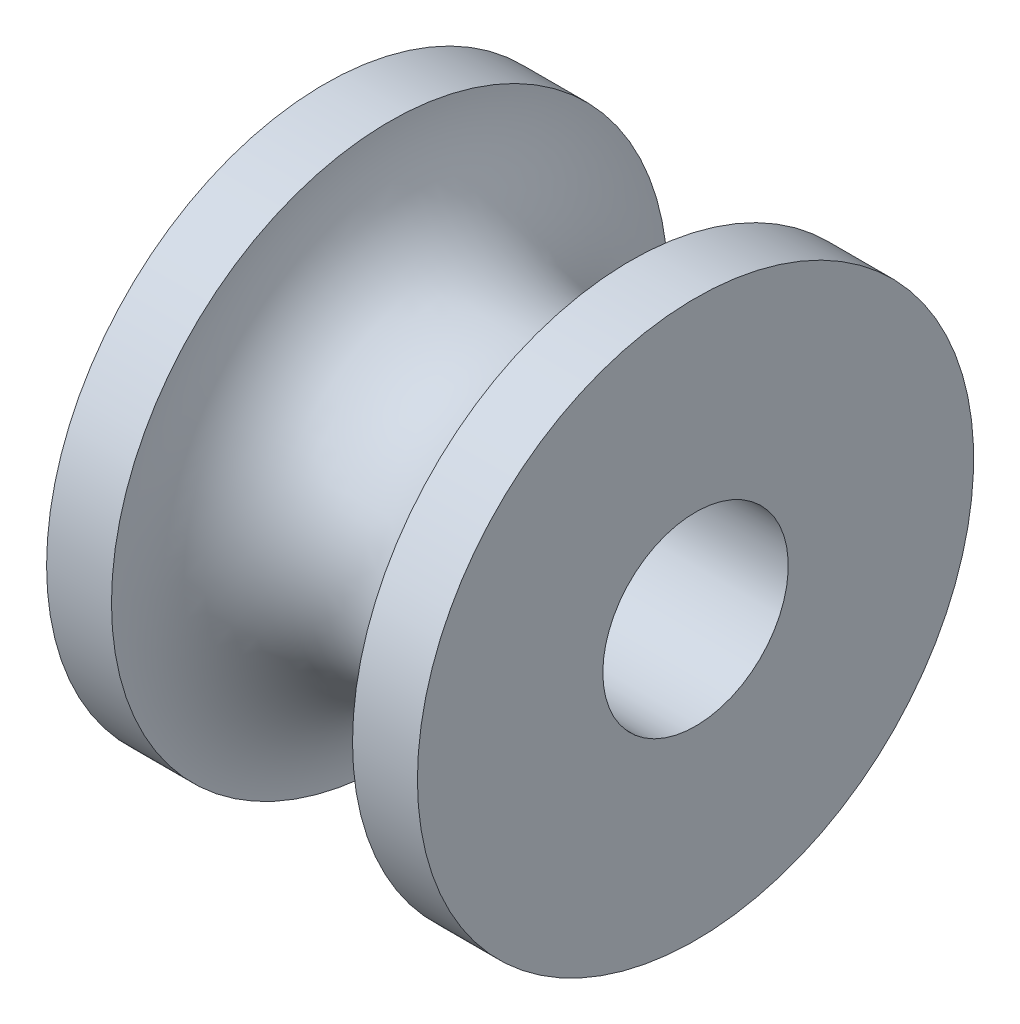
ISO-10303-21;
HEADER;
FILE_DESCRIPTION(('STEP AP214'),'2;1');
FILE_NAME('part.step','',(''),(''),'','','');
FILE_SCHEMA(('AUTOMOTIVE_DESIGN { 1 0 10303 214 1 1 1 1 }'));
ENDSEC;
DATA;
#1=APPLICATION_CONTEXT('core data for automotive mechanical design processes');
#2=APPLICATION_PROTOCOL_DEFINITION('international standard','automotive_design',2000,#1);
#3=PRODUCT_CONTEXT('',#1,'mechanical');
#4=PRODUCT('Part','Part','',(#3));
#5=PRODUCT_RELATED_PRODUCT_CATEGORY('part','',(#4));
#6=PRODUCT_DEFINITION_FORMATION('','',#4);
#7=PRODUCT_DEFINITION_CONTEXT('part definition',#1,'design');
#8=PRODUCT_DEFINITION('design','',#6,#7);
#9=PRODUCT_DEFINITION_SHAPE('','',#8);
#10=(LENGTH_UNIT() NAMED_UNIT(*) SI_UNIT(.MILLI.,.METRE.));
#11=(NAMED_UNIT(*) PLANE_ANGLE_UNIT() SI_UNIT($,.RADIAN.));
#12=(NAMED_UNIT(*) SI_UNIT($,.STERADIAN.) SOLID_ANGLE_UNIT());
#13=UNCERTAINTY_MEASURE_WITH_UNIT(LENGTH_MEASURE(1.E-05),#10,'distance_accuracy_value','');
#14=(GEOMETRIC_REPRESENTATION_CONTEXT(3) GLOBAL_UNCERTAINTY_ASSIGNED_CONTEXT((#13)) GLOBAL_UNIT_ASSIGNED_CONTEXT((#10,
#11,#12)) REPRESENTATION_CONTEXT('',''));
#15=CARTESIAN_POINT('',(0.,0.,0.));
#16=DIRECTION('',(0.,0.,1.));
#17=DIRECTION('',(1.,0.,0.));
#18=AXIS2_PLACEMENT_3D('',#15,#16,#17);
#19=CARTESIAN_POINT('',(-4.,-2.,0.));
#20=DIRECTION('',(-1.,0.,0.));
#21=DIRECTION('',(0.,0.,1.));
#22=AXIS2_PLACEMENT_3D('',#19,#20,#21);
#23=PLANE('',#22);
#24=CARTESIAN_POINT('',(-4.,0.,0.));
#25=DIRECTION('',(-1.,0.,0.));
#26=DIRECTION('',(0.,0.,1.));
#27=AXIS2_PLACEMENT_3D('',#24,#25,#26);
#28=CIRCLE('',#27,6.00000000000001);
#29=CARTESIAN_POINT('',(-4.,0.,6.00000000000001));
#30=VERTEX_POINT('',#29);
#31=EDGE_CURVE('E57',#30,#30,#28,.T.);
#32=ORIENTED_EDGE('',*,*,#31,.T.);
#33=EDGE_LOOP('',(#32));
#34=FACE_BOUND('',#33,.T.);
#35=CARTESIAN_POINT('',(-4.,0.,0.));
#36=DIRECTION('',(-1.,0.,0.));
#37=DIRECTION('',(0.,0.,1.));
#38=AXIS2_PLACEMENT_3D('',#35,#36,#37);
#39=CIRCLE('',#38,2.);
#40=CARTESIAN_POINT('',(-4.,0.,2.));
#41=VERTEX_POINT('',#40);
#42=EDGE_CURVE('E10',#41,#41,#39,.T.);
#43=ORIENTED_EDGE('',*,*,#42,.F.);
#44=EDGE_LOOP('',(#43));
#45=FACE_BOUND('',#44,.T.);
#46=ADVANCED_FACE('F35',(#34,#45),#23,.T.);
#47=CARTESIAN_POINT('',(-9.59945258867054,0.,0.));
#48=DIRECTION('',(-1.,0.,0.));
#49=DIRECTION('',(0.,0.,1.));
#50=AXIS2_PLACEMENT_3D('',#47,#48,#49);
#51=CYLINDRICAL_SURFACE('',#50,2.);
#52=ORIENTED_EDGE('',*,*,#42,.T.);
#53=EDGE_LOOP('',(#52));
#54=FACE_BOUND('',#53,.T.);
#55=CARTESIAN_POINT('',(4.,0.,0.));
#56=DIRECTION('',(-1.,0.,0.));
#57=DIRECTION('',(0.,0.,1.));
#58=AXIS2_PLACEMENT_3D('',#55,#56,#57);
#59=CIRCLE('',#58,2.);
#60=CARTESIAN_POINT('',(4.,0.,2.));
#61=VERTEX_POINT('',#60);
#62=EDGE_CURVE('E41',#61,#61,#59,.T.);
#63=ORIENTED_EDGE('',*,*,#62,.F.);
#64=EDGE_LOOP('',(#63));
#65=FACE_BOUND('',#64,.T.);
#66=ADVANCED_FACE('F75',(#54,#65),#51,.F.);
#67=CARTESIAN_POINT('',(4.,-2.,0.));
#68=DIRECTION('',(1.,0.,0.));
#69=DIRECTION('',(0.,0.,-1.));
#70=AXIS2_PLACEMENT_3D('',#67,#68,#69);
#71=PLANE('',#70);
#72=ORIENTED_EDGE('',*,*,#62,.T.);
#73=EDGE_LOOP('',(#72));
#74=FACE_BOUND('',#73,.T.);
#75=CARTESIAN_POINT('',(4.,0.,0.));
#76=DIRECTION('',(-1.,0.,0.));
#77=DIRECTION('',(0.,0.,1.));
#78=AXIS2_PLACEMENT_3D('',#75,#76,#77);
#79=CIRCLE('',#78,6.00000000000001);
#80=CARTESIAN_POINT('',(4.,0.,6.00000000000001));
#81=VERTEX_POINT('',#80);
#82=EDGE_CURVE('E45',#81,#81,#79,.T.);
#83=ORIENTED_EDGE('',*,*,#82,.F.);
#84=EDGE_LOOP('',(#83));
#85=FACE_BOUND('',#84,.T.);
#86=ADVANCED_FACE('F79',(#74,#85),#71,.T.);
#87=CARTESIAN_POINT('',(-9.59945258867054,0.,0.));
#88=DIRECTION('',(-1.,0.,0.));
#89=DIRECTION('',(0.,0.,1.));
#90=AXIS2_PLACEMENT_3D('',#87,#88,#89);
#91=CYLINDRICAL_SURFACE('',#90,6.00000000000001);
#92=ORIENTED_EDGE('',*,*,#82,.T.);
#93=EDGE_LOOP('',(#92));
#94=FACE_BOUND('',#93,.T.);
#95=CARTESIAN_POINT('',(2.6,0.,0.));
#96=DIRECTION('',(-1.,0.,0.));
#97=DIRECTION('',(0.,0.,1.));
#98=AXIS2_PLACEMENT_3D('',#95,#96,#97);
#99=CIRCLE('',#98,6.00000000000001);
#100=CARTESIAN_POINT('',(2.6,0.,6.00000000000001));
#101=VERTEX_POINT('',#100);
#102=EDGE_CURVE('E49',#101,#101,#99,.T.);
#103=ORIENTED_EDGE('',*,*,#102,.F.);
#104=EDGE_LOOP('',(#103));
#105=FACE_BOUND('',#104,.T.);
#106=ADVANCED_FACE('F71',(#94,#105),#91,.T.);
#107=CARTESIAN_POINT('',(0.,0.,0.));
#108=DIRECTION('',(-1.,0.,0.));
#109=DIRECTION('',(0.,0.,1.));
#110=AXIS2_PLACEMENT_3D('',#107,#108,#109);
#111=TOROIDAL_SURFACE('',#110,6.00000000000001,2.6);
#112=ORIENTED_EDGE('',*,*,#102,.T.);
#113=EDGE_LOOP('',(#112));
#114=FACE_BOUND('',#113,.T.);
#115=CARTESIAN_POINT('',(-2.6,0.,0.));
#116=DIRECTION('',(-1.,0.,0.));
#117=DIRECTION('',(0.,0.,1.));
#118=AXIS2_PLACEMENT_3D('',#115,#116,#117);
#119=CIRCLE('',#118,6.00000000000001);
#120=CARTESIAN_POINT('',(-2.6,0.,6.00000000000001));
#121=VERTEX_POINT('',#120);
#122=EDGE_CURVE('E54',#121,#121,#119,.T.);
#123=ORIENTED_EDGE('',*,*,#122,.F.);
#124=EDGE_LOOP('',(#123));
#125=FACE_BOUND('',#124,.T.);
#126=ADVANCED_FACE('F65',(#114,#125),#111,.F.);
#127=CARTESIAN_POINT('',(-9.59945258867054,0.,0.));
#128=DIRECTION('',(-1.,0.,0.));
#129=DIRECTION('',(0.,0.,1.));
#130=AXIS2_PLACEMENT_3D('',#127,#128,#129);
#131=CYLINDRICAL_SURFACE('',#130,6.00000000000001);
#132=ORIENTED_EDGE('',*,*,#122,.T.);
#133=EDGE_LOOP('',(#132));
#134=FACE_BOUND('',#133,.T.);
#135=ORIENTED_EDGE('',*,*,#31,.F.);
#136=EDGE_LOOP('',(#135));
#137=FACE_BOUND('',#136,.T.);
#138=ADVANCED_FACE('F63',(#134,#137),#131,.T.);
#139=CLOSED_SHELL('',(#46,#66,#86,#106,#126,#138));
#140=MANIFOLD_SOLID_BREP('B2',#139);
#141=ADVANCED_BREP_SHAPE_REPRESENTATION('',(#18,#140),#14);
#142=SHAPE_DEFINITION_REPRESENTATION(#9,#141);
ENDSEC;
END-ISO-10303-21;
